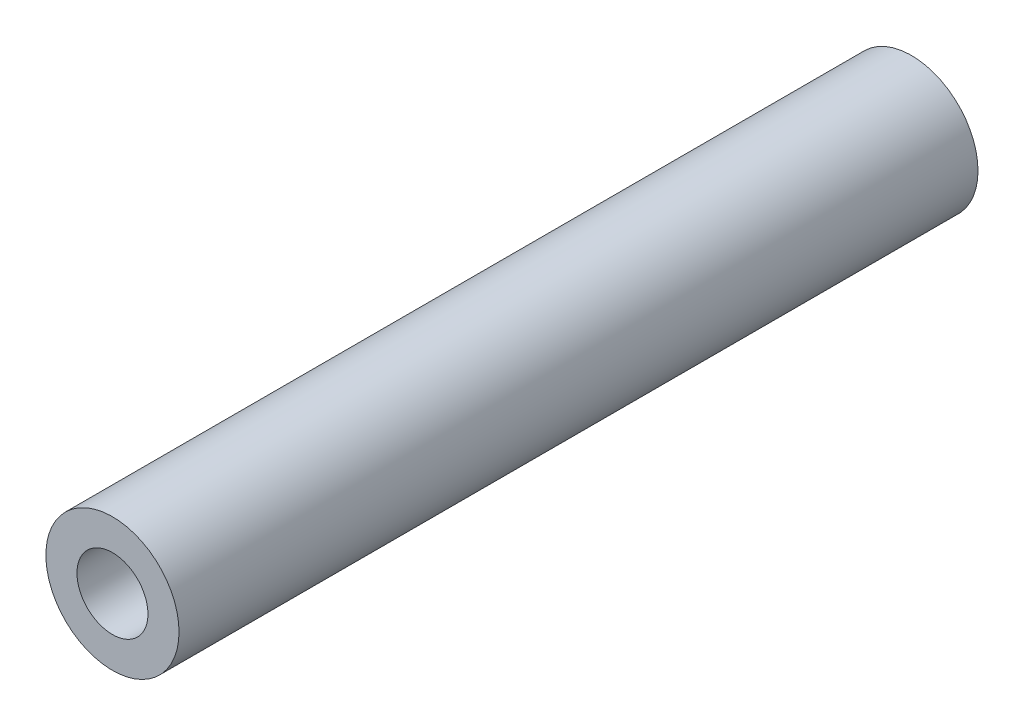
ISO-10303-21;
HEADER;
FILE_DESCRIPTION(('STEP AP214'),'2;1');
FILE_NAME('part.step','',(''),(''),'','','');
FILE_SCHEMA(('AUTOMOTIVE_DESIGN { 1 0 10303 214 1 1 1 1 }'));
ENDSEC;
DATA;
#1=APPLICATION_CONTEXT('core data for automotive mechanical design processes');
#2=APPLICATION_PROTOCOL_DEFINITION('international standard','automotive_design',2000,#1);
#3=PRODUCT_CONTEXT('',#1,'mechanical');
#4=PRODUCT('Part','Part','',(#3));
#5=PRODUCT_RELATED_PRODUCT_CATEGORY('part','',(#4));
#6=PRODUCT_DEFINITION_FORMATION('','',#4);
#7=PRODUCT_DEFINITION_CONTEXT('part definition',#1,'design');
#8=PRODUCT_DEFINITION('design','',#6,#7);
#9=PRODUCT_DEFINITION_SHAPE('','',#8);
#10=(LENGTH_UNIT() NAMED_UNIT(*) SI_UNIT(.MILLI.,.METRE.));
#11=(NAMED_UNIT(*) PLANE_ANGLE_UNIT() SI_UNIT($,.RADIAN.));
#12=(NAMED_UNIT(*) SI_UNIT($,.STERADIAN.) SOLID_ANGLE_UNIT());
#13=UNCERTAINTY_MEASURE_WITH_UNIT(LENGTH_MEASURE(1.E-05),#10,'distance_accuracy_value','');
#14=(GEOMETRIC_REPRESENTATION_CONTEXT(3) GLOBAL_UNCERTAINTY_ASSIGNED_CONTEXT((#13)) GLOBAL_UNIT_ASSIGNED_CONTEXT((#10,
#11,#12)) REPRESENTATION_CONTEXT('',''));
#15=CARTESIAN_POINT('',(0.,0.,0.));
#16=DIRECTION('',(0.,0.,1.));
#17=DIRECTION('',(1.,0.,0.));
#18=AXIS2_PLACEMENT_3D('',#15,#16,#17);
#19=CARTESIAN_POINT('',(0.,0.,36.));
#20=DIRECTION('',(0.,0.,-1.));
#21=DIRECTION('',(-1.,0.,0.));
#22=AXIS2_PLACEMENT_3D('',#19,#20,#21);
#23=CYLINDRICAL_SURFACE('',#22,3.);
#24=CARTESIAN_POINT('',(0.,0.,36.));
#25=DIRECTION('',(0.,0.,1.));
#26=DIRECTION('',(1.,0.,0.));
#27=AXIS2_PLACEMENT_3D('',#24,#25,#26);
#28=CIRCLE('',#27,3.);
#29=CARTESIAN_POINT('',(3.,0.,36.));
#30=VERTEX_POINT('',#29);
#31=EDGE_CURVE('E10',#30,#30,#28,.T.);
#32=ORIENTED_EDGE('',*,*,#31,.F.);
#33=EDGE_LOOP('',(#32));
#34=FACE_BOUND('',#33,.T.);
#35=CARTESIAN_POINT('',(0.,0.,0.));
#36=DIRECTION('',(0.,0.,1.));
#37=DIRECTION('',(1.,0.,0.));
#38=AXIS2_PLACEMENT_3D('',#35,#36,#37);
#39=CIRCLE('',#38,3.);
#40=CARTESIAN_POINT('',(3.,0.,0.));
#41=VERTEX_POINT('',#40);
#42=EDGE_CURVE('E40',#41,#41,#39,.T.);
#43=ORIENTED_EDGE('',*,*,#42,.T.);
#44=EDGE_LOOP('',(#43));
#45=FACE_BOUND('',#44,.T.);
#46=ADVANCED_FACE('F37',(#34,#45),#23,.T.);
#47=CARTESIAN_POINT('',(0.,0.,36.));
#48=DIRECTION('',(0.,0.,1.));
#49=DIRECTION('',(1.,0.,0.));
#50=AXIS2_PLACEMENT_3D('',#47,#48,#49);
#51=PLANE('',#50);
#52=CARTESIAN_POINT('',(0.,0.,36.));
#53=DIRECTION('',(0.,0.,1.));
#54=DIRECTION('',(1.,0.,0.));
#55=AXIS2_PLACEMENT_3D('',#52,#53,#54);
#56=CIRCLE('',#55,1.6);
#57=CARTESIAN_POINT('',(1.6,0.,36.));
#58=VERTEX_POINT('',#57);
#59=EDGE_CURVE('E51',#58,#58,#56,.T.);
#60=ORIENTED_EDGE('',*,*,#59,.F.);
#61=EDGE_LOOP('',(#60));
#62=FACE_BOUND('',#61,.T.);
#63=ORIENTED_EDGE('',*,*,#31,.T.);
#64=EDGE_LOOP('',(#63));
#65=FACE_BOUND('',#64,.T.);
#66=ADVANCED_FACE('F68',(#62,#65),#51,.T.);
#67=CARTESIAN_POINT('',(0.,0.,0.));
#68=DIRECTION('',(0.,0.,1.));
#69=DIRECTION('',(1.,0.,0.));
#70=AXIS2_PLACEMENT_3D('',#67,#68,#69);
#71=PLANE('',#70);
#72=CARTESIAN_POINT('',(0.,0.,0.));
#73=DIRECTION('',(0.,0.,1.));
#74=DIRECTION('',(1.,0.,0.));
#75=AXIS2_PLACEMENT_3D('',#72,#73,#74);
#76=CIRCLE('',#75,1.6);
#77=CARTESIAN_POINT('',(1.6,0.,0.));
#78=VERTEX_POINT('',#77);
#79=EDGE_CURVE('E49',#78,#78,#76,.T.);
#80=ORIENTED_EDGE('',*,*,#79,.T.);
#81=EDGE_LOOP('',(#80));
#82=FACE_BOUND('',#81,.T.);
#83=ORIENTED_EDGE('',*,*,#42,.F.);
#84=EDGE_LOOP('',(#83));
#85=FACE_BOUND('',#84,.T.);
#86=ADVANCED_FACE('F59',(#82,#85),#71,.F.);
#87=CARTESIAN_POINT('',(0.,0.,0.));
#88=DIRECTION('',(0.,0.,1.));
#89=DIRECTION('',(1.,0.,0.));
#90=AXIS2_PLACEMENT_3D('',#87,#88,#89);
#91=CYLINDRICAL_SURFACE('',#90,1.6);
#92=ORIENTED_EDGE('',*,*,#79,.F.);
#93=EDGE_LOOP('',(#92));
#94=FACE_BOUND('',#93,.T.);
#95=ORIENTED_EDGE('',*,*,#59,.T.);
#96=EDGE_LOOP('',(#95));
#97=FACE_BOUND('',#96,.T.);
#98=ADVANCED_FACE('F62',(#94,#97),#91,.F.);
#99=CLOSED_SHELL('',(#46,#66,#86,#98));
#100=MANIFOLD_SOLID_BREP('B2',#99);
#101=ADVANCED_BREP_SHAPE_REPRESENTATION('',(#18,#100),#14);
#102=SHAPE_DEFINITION_REPRESENTATION(#9,#101);
ENDSEC;
END-ISO-10303-21;
